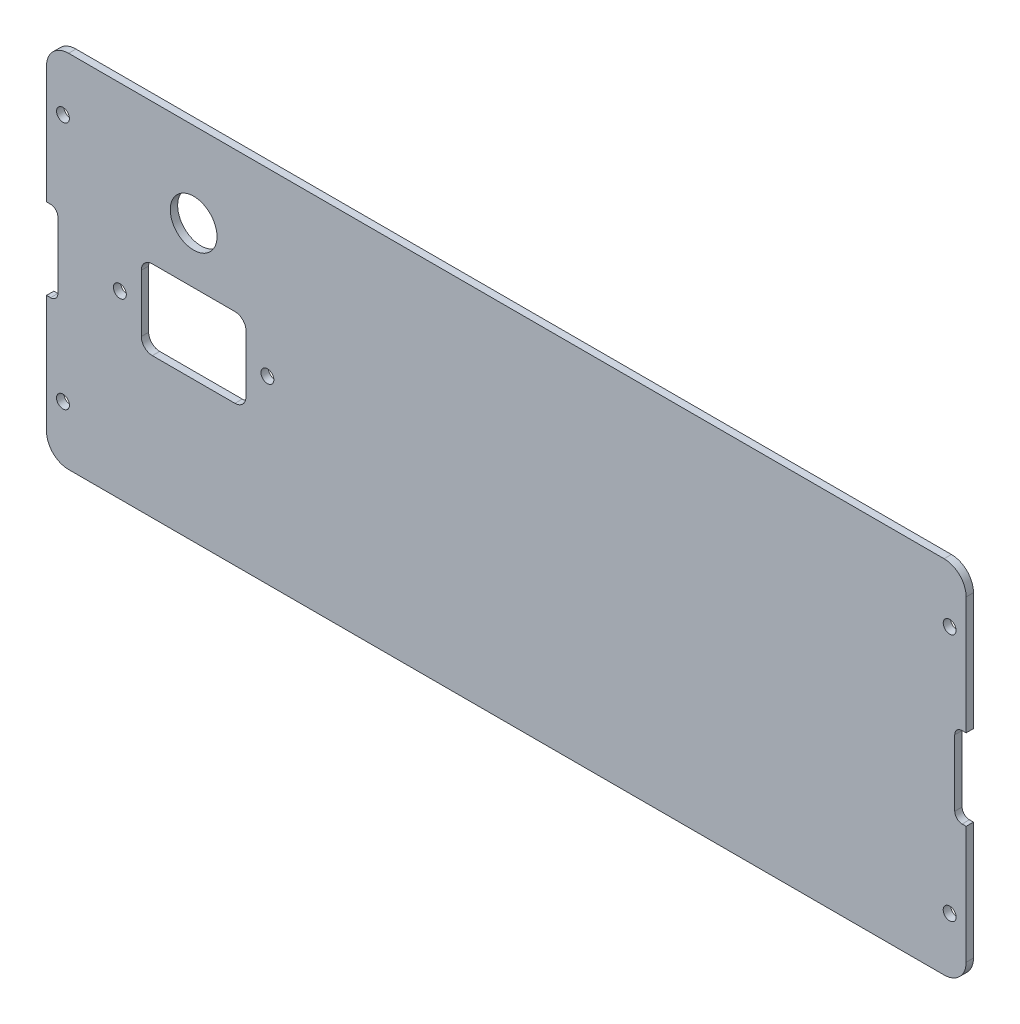
ISO-10303-21;
HEADER;
FILE_DESCRIPTION(('STEP AP214'),'2;1');
FILE_NAME('part.step','',(''),(''),'','','');
FILE_SCHEMA(('AUTOMOTIVE_DESIGN { 1 0 10303 214 1 1 1 1 }'));
ENDSEC;
DATA;
#1=APPLICATION_CONTEXT('core data for automotive mechanical design processes');
#2=APPLICATION_PROTOCOL_DEFINITION('international standard','automotive_design',2000,#1);
#3=PRODUCT_CONTEXT('',#1,'mechanical');
#4=PRODUCT('Part','Part','',(#3));
#5=PRODUCT_RELATED_PRODUCT_CATEGORY('part','',(#4));
#6=PRODUCT_DEFINITION_FORMATION('','',#4);
#7=PRODUCT_DEFINITION_CONTEXT('part definition',#1,'design');
#8=PRODUCT_DEFINITION('design','',#6,#7);
#9=PRODUCT_DEFINITION_SHAPE('','',#8);
#10=(LENGTH_UNIT() NAMED_UNIT(*) SI_UNIT(.MILLI.,.METRE.));
#11=(NAMED_UNIT(*) PLANE_ANGLE_UNIT() SI_UNIT($,.RADIAN.));
#12=(NAMED_UNIT(*) SI_UNIT($,.STERADIAN.) SOLID_ANGLE_UNIT());
#13=UNCERTAINTY_MEASURE_WITH_UNIT(LENGTH_MEASURE(1.E-05),#10,'distance_accuracy_value','');
#14=(GEOMETRIC_REPRESENTATION_CONTEXT(3) GLOBAL_UNCERTAINTY_ASSIGNED_CONTEXT((#13)) GLOBAL_UNIT_ASSIGNED_CONTEXT((#10,
#11,#12)) REPRESENTATION_CONTEXT('',''));
#15=CARTESIAN_POINT('',(0.,0.,0.));
#16=DIRECTION('',(0.,0.,1.));
#17=DIRECTION('',(1.,0.,0.));
#18=AXIS2_PLACEMENT_3D('',#15,#16,#17);
#19=CARTESIAN_POINT('',(0.,0.,2.));
#20=DIRECTION('',(0.,0.,-1.));
#21=DIRECTION('',(-1.,0.,0.));
#22=AXIS2_PLACEMENT_3D('',#19,#20,#21);
#23=PLANE('',#22);
#24=CARTESIAN_POINT('',(-85.,26.,2.));
#25=DIRECTION('',(0.,0.,1.));
#26=DIRECTION('',(1.,0.,0.));
#27=AXIS2_PLACEMENT_3D('',#24,#25,#26);
#28=CIRCLE('',#27,6.35);
#29=CARTESIAN_POINT('',(-78.65,26.,2.));
#30=VERTEX_POINT('',#29);
#31=EDGE_CURVE('E383',#30,#30,#28,.T.);
#32=ORIENTED_EDGE('',*,*,#31,.F.);
#33=EDGE_LOOP('',(#32));
#34=FACE_BOUND('',#33,.T.);
#35=CARTESIAN_POINT('',(-64.95,0.,2.));
#36=DIRECTION('',(0.,0.,1.));
#37=DIRECTION('',(1.,0.,0.));
#38=AXIS2_PLACEMENT_3D('',#35,#36,#37);
#39=CIRCLE('',#38,1.75);
#40=CARTESIAN_POINT('',(-63.2,0.,2.));
#41=VERTEX_POINT('',#40);
#42=EDGE_CURVE('E379',#41,#41,#39,.T.);
#43=ORIENTED_EDGE('',*,*,#42,.F.);
#44=EDGE_LOOP('',(#43));
#45=FACE_BOUND('',#44,.T.);
#46=CARTESIAN_POINT('',(-105.05,0.,2.));
#47=DIRECTION('',(0.,0.,1.));
#48=DIRECTION('',(1.,0.,0.));
#49=AXIS2_PLACEMENT_3D('',#46,#47,#48);
#50=CIRCLE('',#49,1.75);
#51=CARTESIAN_POINT('',(-103.3,0.,2.));
#52=VERTEX_POINT('',#51);
#53=EDGE_CURVE('E375',#52,#52,#50,.T.);
#54=ORIENTED_EDGE('',*,*,#53,.F.);
#55=EDGE_LOOP('',(#54));
#56=FACE_BOUND('',#55,.T.);
#57=DIRECTION('',(-1.,0.,0.));
#58=VECTOR('',#57,1.);
#59=CARTESIAN_POINT('',(-99.225,10.8,2.));
#60=LINE('',#59,#58);
#61=CARTESIAN_POINT('',(-73.775,10.8,2.));
#62=VERTEX_POINT('',#61);
#63=CARTESIAN_POINT('',(-96.225,10.8,2.));
#64=VERTEX_POINT('',#63);
#65=EDGE_CURVE('E523',#62,#64,#60,.T.);
#66=ORIENTED_EDGE('',*,*,#65,.F.);
#67=CARTESIAN_POINT('',(-73.775,7.8,2.));
#68=DIRECTION('',(0.,0.,-1.));
#69=DIRECTION('',(-1.,0.,0.));
#70=AXIS2_PLACEMENT_3D('',#67,#68,#69);
#71=CIRCLE('',#70,3.);
#72=CARTESIAN_POINT('',(-70.775,7.79999999999999,2.));
#73=VERTEX_POINT('',#72);
#74=EDGE_CURVE('E55',#62,#73,#71,.T.);
#75=ORIENTED_EDGE('',*,*,#74,.T.);
#76=DIRECTION('',(0.,1.,0.));
#77=VECTOR('',#76,1.);
#78=CARTESIAN_POINT('',(-70.775,-10.8,2.));
#79=LINE('',#78,#77);
#80=CARTESIAN_POINT('',(-70.775,-7.8,2.));
#81=VERTEX_POINT('',#80);
#82=EDGE_CURVE('E374',#81,#73,#79,.T.);
#83=ORIENTED_EDGE('',*,*,#82,.F.);
#84=CARTESIAN_POINT('',(-73.775,-7.8,2.));
#85=DIRECTION('',(0.,0.,-1.));
#86=DIRECTION('',(-1.,0.,0.));
#87=AXIS2_PLACEMENT_3D('',#84,#85,#86);
#88=CIRCLE('',#87,3.);
#89=CARTESIAN_POINT('',(-73.775,-10.8,2.));
#90=VERTEX_POINT('',#89);
#91=EDGE_CURVE('E406',#81,#90,#88,.T.);
#92=ORIENTED_EDGE('',*,*,#91,.T.);
#93=DIRECTION('',(1.,0.,0.));
#94=VECTOR('',#93,1.);
#95=CARTESIAN_POINT('',(-99.225,-10.8,2.));
#96=LINE('',#95,#94);
#97=CARTESIAN_POINT('',(-96.225,-10.8,2.));
#98=VERTEX_POINT('',#97);
#99=EDGE_CURVE('E517',#98,#90,#96,.T.);
#100=ORIENTED_EDGE('',*,*,#99,.F.);
#101=CARTESIAN_POINT('',(-96.225,-7.8,2.));
#102=DIRECTION('',(0.,0.,-1.));
#103=DIRECTION('',(-1.,0.,0.));
#104=AXIS2_PLACEMENT_3D('',#101,#102,#103);
#105=CIRCLE('',#104,3.);
#106=CARTESIAN_POINT('',(-99.225,-7.8,2.));
#107=VERTEX_POINT('',#106);
#108=EDGE_CURVE('E402',#98,#107,#105,.T.);
#109=ORIENTED_EDGE('',*,*,#108,.T.);
#110=DIRECTION('',(0.,-1.,0.));
#111=VECTOR('',#110,1.);
#112=CARTESIAN_POINT('',(-99.225,-10.8,2.));
#113=LINE('',#112,#111);
#114=CARTESIAN_POINT('',(-99.225,7.79999999999999,2.));
#115=VERTEX_POINT('',#114);
#116=EDGE_CURVE('E525',#115,#107,#113,.T.);
#117=ORIENTED_EDGE('',*,*,#116,.F.);
#118=CARTESIAN_POINT('',(-96.225,7.8,2.));
#119=DIRECTION('',(0.,0.,-1.));
#120=DIRECTION('',(-1.,0.,0.));
#121=AXIS2_PLACEMENT_3D('',#118,#119,#120);
#122=CIRCLE('',#121,3.);
#123=EDGE_CURVE('E41',#115,#64,#122,.T.);
#124=ORIENTED_EDGE('',*,*,#123,.T.);
#125=EDGE_LOOP('',(#66,#75,#83,#92,#100,#109,#117,#124));
#126=FACE_BOUND('',#125,.T.);
#127=CARTESIAN_POINT('',(-120.52,33.75,2.));
#128=DIRECTION('',(0.,0.,1.));
#129=DIRECTION('',(1.,0.,0.));
#130=AXIS2_PLACEMENT_3D('',#127,#128,#129);
#131=CIRCLE('',#130,1.74999999999999);
#132=CARTESIAN_POINT('',(-118.77,33.75,2.));
#133=VERTEX_POINT('',#132);
#134=EDGE_CURVE('E533',#133,#133,#131,.T.);
#135=ORIENTED_EDGE('',*,*,#134,.F.);
#136=EDGE_LOOP('',(#135));
#137=FACE_BOUND('',#136,.T.);
#138=CARTESIAN_POINT('',(-120.52,-33.75,2.));
#139=DIRECTION('',(0.,0.,1.));
#140=DIRECTION('',(1.,0.,0.));
#141=AXIS2_PLACEMENT_3D('',#138,#139,#140);
#142=CIRCLE('',#141,1.74999999999999);
#143=CARTESIAN_POINT('',(-118.77,-33.75,2.));
#144=VERTEX_POINT('',#143);
#145=EDGE_CURVE('E539',#144,#144,#142,.T.);
#146=ORIENTED_EDGE('',*,*,#145,.F.);
#147=EDGE_LOOP('',(#146));
#148=FACE_BOUND('',#147,.T.);
#149=CARTESIAN_POINT('',(120.52,33.75,2.));
#150=DIRECTION('',(0.,0.,1.));
#151=DIRECTION('',(1.,0.,0.));
#152=AXIS2_PLACEMENT_3D('',#149,#150,#151);
#153=CIRCLE('',#152,1.74999999999999);
#154=CARTESIAN_POINT('',(122.27,33.75,2.));
#155=VERTEX_POINT('',#154);
#156=EDGE_CURVE('E551',#155,#155,#153,.T.);
#157=ORIENTED_EDGE('',*,*,#156,.F.);
#158=EDGE_LOOP('',(#157));
#159=FACE_BOUND('',#158,.T.);
#160=DIRECTION('',(0.,1.,0.));
#161=VECTOR('',#160,1.);
#162=CARTESIAN_POINT('',(125.,-49.,2.));
#163=LINE('',#162,#161);
#164=CARTESIAN_POINT('',(125.,-43.,2.));
#165=VERTEX_POINT('',#164);
#166=CARTESIAN_POINT('',(125.,-11.,2.));
#167=VERTEX_POINT('',#166);
#168=EDGE_CURVE('E245',#165,#167,#163,.T.);
#169=ORIENTED_EDGE('',*,*,#168,.T.);
#170=DIRECTION('',(1.,0.,0.));
#171=VECTOR('',#170,1.);
#172=CARTESIAN_POINT('',(128.100000000001,-11.,2.));
#173=LINE('',#172,#171);
#174=CARTESIAN_POINT('',(123.900000000001,-11.,2.));
#175=VERTEX_POINT('',#174);
#176=EDGE_CURVE('E229',#175,#167,#173,.T.);
#177=ORIENTED_EDGE('',*,*,#176,.F.);
#178=CARTESIAN_POINT('',(123.900000000001,-8.99999999999997,2.));
#179=DIRECTION('',(0.,0.,-1.));
#180=DIRECTION('',(-1.,0.,0.));
#181=AXIS2_PLACEMENT_3D('',#178,#179,#180);
#182=CIRCLE('',#181,2.);
#183=CARTESIAN_POINT('',(121.900000000001,-8.99999999999997,2.));
#184=VERTEX_POINT('',#183);
#185=EDGE_CURVE('E343',#175,#184,#182,.T.);
#186=ORIENTED_EDGE('',*,*,#185,.T.);
#187=DIRECTION('',(0.,-1.,0.));
#188=VECTOR('',#187,1.);
#189=CARTESIAN_POINT('',(121.900000000001,-11.,2.));
#190=LINE('',#189,#188);
#191=CARTESIAN_POINT('',(121.900000000001,9.00000000000002,2.));
#192=VERTEX_POINT('',#191);
#193=EDGE_CURVE('E238',#192,#184,#190,.T.);
#194=ORIENTED_EDGE('',*,*,#193,.F.);
#195=CARTESIAN_POINT('',(123.900000000001,9.00000000000003,2.));
#196=DIRECTION('',(0.,0.,-1.));
#197=DIRECTION('',(-1.,0.,0.));
#198=AXIS2_PLACEMENT_3D('',#195,#196,#197);
#199=CIRCLE('',#198,2.);
#200=CARTESIAN_POINT('',(123.900000000001,11.,2.));
#201=VERTEX_POINT('',#200);
#202=EDGE_CURVE('E237',#192,#201,#199,.T.);
#203=ORIENTED_EDGE('',*,*,#202,.T.);
#204=DIRECTION('',(-1.,0.,0.));
#205=VECTOR('',#204,1.);
#206=CARTESIAN_POINT('',(128.100000000001,11.,2.));
#207=LINE('',#206,#205);
#208=CARTESIAN_POINT('',(125.,11.,2.));
#209=VERTEX_POINT('',#208);
#210=EDGE_CURVE('E221',#209,#201,#207,.T.);
#211=ORIENTED_EDGE('',*,*,#210,.F.);
#212=CARTESIAN_POINT('',(125.,43.,2.));
#213=VERTEX_POINT('',#212);
#214=EDGE_CURVE('E234',#209,#213,#163,.T.);
#215=ORIENTED_EDGE('',*,*,#214,.T.);
#216=CARTESIAN_POINT('',(119.,43.,2.));
#217=DIRECTION('',(0.,0.,-1.));
#218=DIRECTION('',(-1.,0.,0.));
#219=AXIS2_PLACEMENT_3D('',#216,#217,#218);
#220=CIRCLE('',#219,6.);
#221=CARTESIAN_POINT('',(119.,49.,2.));
#222=VERTEX_POINT('',#221);
#223=EDGE_CURVE('E293',#213,#222,#220,.F.);
#224=ORIENTED_EDGE('',*,*,#223,.T.);
#225=DIRECTION('',(1.,0.,0.));
#226=VECTOR('',#225,1.);
#227=CARTESIAN_POINT('',(-125.,49.,2.));
#228=LINE('',#227,#226);
#229=CARTESIAN_POINT('',(-119.,49.,2.));
#230=VERTEX_POINT('',#229);
#231=EDGE_CURVE('E246',#230,#222,#228,.T.);
#232=ORIENTED_EDGE('',*,*,#231,.F.);
#233=CARTESIAN_POINT('',(-119.,43.,2.));
#234=DIRECTION('',(0.,0.,-1.));
#235=DIRECTION('',(-1.,0.,0.));
#236=AXIS2_PLACEMENT_3D('',#233,#234,#235);
#237=CIRCLE('',#236,6.);
#238=CARTESIAN_POINT('',(-125.,43.,2.));
#239=VERTEX_POINT('',#238);
#240=EDGE_CURVE('E290',#230,#239,#237,.F.);
#241=ORIENTED_EDGE('',*,*,#240,.T.);
#242=DIRECTION('',(0.,1.,0.));
#243=VECTOR('',#242,1.);
#244=CARTESIAN_POINT('',(-125.,-49.,2.));
#245=LINE('',#244,#243);
#246=CARTESIAN_POINT('',(-125.,11.,2.));
#247=VERTEX_POINT('',#246);
#248=EDGE_CURVE('E271',#247,#239,#245,.T.);
#249=ORIENTED_EDGE('',*,*,#248,.F.);
#250=DIRECTION('',(-1.,0.,0.));
#251=VECTOR('',#250,1.);
#252=CARTESIAN_POINT('',(-128.100000000001,11.,2.));
#253=LINE('',#252,#251);
#254=CARTESIAN_POINT('',(-123.900000000001,11.,2.));
#255=VERTEX_POINT('',#254);
#256=EDGE_CURVE('E564',#255,#247,#253,.T.);
#257=ORIENTED_EDGE('',*,*,#256,.F.);
#258=CARTESIAN_POINT('',(-123.900000000001,9.,2.));
#259=DIRECTION('',(0.,0.,-1.));
#260=DIRECTION('',(-1.,0.,0.));
#261=AXIS2_PLACEMENT_3D('',#258,#259,#260);
#262=CIRCLE('',#261,2.);
#263=CARTESIAN_POINT('',(-121.900000000001,9.,2.));
#264=VERTEX_POINT('',#263);
#265=EDGE_CURVE('E354',#255,#264,#262,.T.);
#266=ORIENTED_EDGE('',*,*,#265,.T.);
#267=DIRECTION('',(0.,1.,0.));
#268=VECTOR('',#267,1.);
#269=CARTESIAN_POINT('',(-121.900000000001,-11.,2.));
#270=LINE('',#269,#268);
#271=CARTESIAN_POINT('',(-121.900000000001,-9.,2.));
#272=VERTEX_POINT('',#271);
#273=EDGE_CURVE('E561',#272,#264,#270,.T.);
#274=ORIENTED_EDGE('',*,*,#273,.F.);
#275=CARTESIAN_POINT('',(-123.900000000001,-9.,2.));
#276=DIRECTION('',(0.,0.,-1.));
#277=DIRECTION('',(-1.,0.,0.));
#278=AXIS2_PLACEMENT_3D('',#275,#276,#277);
#279=CIRCLE('',#278,2.);
#280=CARTESIAN_POINT('',(-123.900000000001,-11.,2.));
#281=VERTEX_POINT('',#280);
#282=EDGE_CURVE('E350',#272,#281,#279,.T.);
#283=ORIENTED_EDGE('',*,*,#282,.T.);
#284=DIRECTION('',(1.,0.,0.));
#285=VECTOR('',#284,1.);
#286=CARTESIAN_POINT('',(-128.100000000001,-11.,2.));
#287=LINE('',#286,#285);
#288=CARTESIAN_POINT('',(-125.,-11.,2.));
#289=VERTEX_POINT('',#288);
#290=EDGE_CURVE('E566',#289,#281,#287,.T.);
#291=ORIENTED_EDGE('',*,*,#290,.F.);
#292=CARTESIAN_POINT('',(-125.,-43.,2.));
#293=VERTEX_POINT('',#292);
#294=EDGE_CURVE('E250',#293,#289,#245,.T.);
#295=ORIENTED_EDGE('',*,*,#294,.F.);
#296=CARTESIAN_POINT('',(-119.,-43.,2.));
#297=DIRECTION('',(0.,0.,-1.));
#298=DIRECTION('',(-1.,0.,0.));
#299=AXIS2_PLACEMENT_3D('',#296,#297,#298);
#300=CIRCLE('',#299,6.);
#301=CARTESIAN_POINT('',(-119.,-49.,2.));
#302=VERTEX_POINT('',#301);
#303=EDGE_CURVE('E297',#293,#302,#300,.F.);
#304=ORIENTED_EDGE('',*,*,#303,.T.);
#305=DIRECTION('',(1.,0.,0.));
#306=VECTOR('',#305,1.);
#307=CARTESIAN_POINT('',(-125.,-49.,2.));
#308=LINE('',#307,#306);
#309=CARTESIAN_POINT('',(119.,-49.,2.));
#310=VERTEX_POINT('',#309);
#311=EDGE_CURVE('E248',#302,#310,#308,.T.);
#312=ORIENTED_EDGE('',*,*,#311,.T.);
#313=CARTESIAN_POINT('',(119.,-43.,2.));
#314=DIRECTION('',(0.,0.,-1.));
#315=DIRECTION('',(-1.,0.,0.));
#316=AXIS2_PLACEMENT_3D('',#313,#314,#315);
#317=CIRCLE('',#316,6.);
#318=EDGE_CURVE('E295',#310,#165,#317,.F.);
#319=ORIENTED_EDGE('',*,*,#318,.T.);
#320=EDGE_LOOP('',(#169,#177,#186,#194,#203,#211,#215,#224,#232,#241,#249,#257,#266,#274,#283,
#291,#295,#304,#312,#319));
#321=FACE_BOUND('',#320,.T.);
#322=CARTESIAN_POINT('',(120.52,-33.75,2.));
#323=DIRECTION('',(0.,0.,1.));
#324=DIRECTION('',(1.,0.,0.));
#325=AXIS2_PLACEMENT_3D('',#322,#323,#324);
#326=CIRCLE('',#325,1.74999999999999);
#327=CARTESIAN_POINT('',(122.27,-33.75,2.));
#328=VERTEX_POINT('',#327);
#329=EDGE_CURVE('E545',#328,#328,#326,.T.);
#330=ORIENTED_EDGE('',*,*,#329,.F.);
#331=EDGE_LOOP('',(#330));
#332=FACE_BOUND('',#331,.T.);
#333=ADVANCED_FACE('F33',(#34,#45,#56,#126,#137,#148,#159,#321,#332),#23,.F.);
#334=CARTESIAN_POINT('',(0.,0.,0.));
#335=DIRECTION('',(0.,0.,-1.));
#336=DIRECTION('',(-1.,0.,0.));
#337=AXIS2_PLACEMENT_3D('',#334,#335,#336);
#338=PLANE('',#337);
#339=CARTESIAN_POINT('',(-85.,26.,0.));
#340=DIRECTION('',(0.,0.,-1.));
#341=DIRECTION('',(-1.,0.,0.));
#342=AXIS2_PLACEMENT_3D('',#339,#340,#341);
#343=CIRCLE('',#342,6.35);
#344=CARTESIAN_POINT('',(-91.35,26.,0.));
#345=VERTEX_POINT('',#344);
#346=EDGE_CURVE('E380',#345,#345,#343,.T.);
#347=ORIENTED_EDGE('',*,*,#346,.F.);
#348=EDGE_LOOP('',(#347));
#349=FACE_BOUND('',#348,.T.);
#350=CARTESIAN_POINT('',(-64.95,0.,0.));
#351=DIRECTION('',(0.,0.,-1.));
#352=DIRECTION('',(-1.,0.,0.));
#353=AXIS2_PLACEMENT_3D('',#350,#351,#352);
#354=CIRCLE('',#353,1.75);
#355=CARTESIAN_POINT('',(-66.7,0.,0.));
#356=VERTEX_POINT('',#355);
#357=EDGE_CURVE('E376',#356,#356,#354,.T.);
#358=ORIENTED_EDGE('',*,*,#357,.F.);
#359=EDGE_LOOP('',(#358));
#360=FACE_BOUND('',#359,.T.);
#361=CARTESIAN_POINT('',(-105.05,0.,0.));
#362=DIRECTION('',(0.,0.,-1.));
#363=DIRECTION('',(-1.,0.,0.));
#364=AXIS2_PLACEMENT_3D('',#361,#362,#363);
#365=CIRCLE('',#364,1.75);
#366=CARTESIAN_POINT('',(-106.8,0.,0.));
#367=VERTEX_POINT('',#366);
#368=EDGE_CURVE('E371',#367,#367,#365,.T.);
#369=ORIENTED_EDGE('',*,*,#368,.F.);
#370=EDGE_LOOP('',(#369));
#371=FACE_BOUND('',#370,.T.);
#372=DIRECTION('',(0.,-1.,0.));
#373=VECTOR('',#372,1.);
#374=CARTESIAN_POINT('',(-70.775,0.,0.));
#375=LINE('',#374,#373);
#376=CARTESIAN_POINT('',(-70.775,7.8,0.));
#377=VERTEX_POINT('',#376);
#378=CARTESIAN_POINT('',(-70.775,-7.8,0.));
#379=VERTEX_POINT('',#378);
#380=EDGE_CURVE('E367',#377,#379,#375,.T.);
#381=ORIENTED_EDGE('',*,*,#380,.F.);
#382=CARTESIAN_POINT('',(-73.775,7.8,0.));
#383=DIRECTION('',(0.,0.,-1.));
#384=DIRECTION('',(-1.,0.,0.));
#385=AXIS2_PLACEMENT_3D('',#382,#383,#384);
#386=CIRCLE('',#385,3.);
#387=CARTESIAN_POINT('',(-73.775,10.8,0.));
#388=VERTEX_POINT('',#387);
#389=EDGE_CURVE('E411',#377,#388,#386,.F.);
#390=ORIENTED_EDGE('',*,*,#389,.T.);
#391=DIRECTION('',(1.,0.,0.));
#392=VECTOR('',#391,1.);
#393=CARTESIAN_POINT('',(0.,10.8,0.));
#394=LINE('',#393,#392);
#395=CARTESIAN_POINT('',(-96.225,10.8,0.));
#396=VERTEX_POINT('',#395);
#397=EDGE_CURVE('E358',#396,#388,#394,.T.);
#398=ORIENTED_EDGE('',*,*,#397,.F.);
#399=CARTESIAN_POINT('',(-96.225,7.8,0.));
#400=DIRECTION('',(0.,0.,-1.));
#401=DIRECTION('',(-1.,0.,0.));
#402=AXIS2_PLACEMENT_3D('',#399,#400,#401);
#403=CIRCLE('',#402,3.);
#404=CARTESIAN_POINT('',(-99.225,7.8,0.));
#405=VERTEX_POINT('',#404);
#406=EDGE_CURVE('E11',#396,#405,#403,.F.);
#407=ORIENTED_EDGE('',*,*,#406,.T.);
#408=DIRECTION('',(0.,1.,0.));
#409=VECTOR('',#408,1.);
#410=CARTESIAN_POINT('',(-99.225,0.,0.));
#411=LINE('',#410,#409);
#412=CARTESIAN_POINT('',(-99.225,-7.8,0.));
#413=VERTEX_POINT('',#412);
#414=EDGE_CURVE('E361',#413,#405,#411,.T.);
#415=ORIENTED_EDGE('',*,*,#414,.F.);
#416=CARTESIAN_POINT('',(-96.225,-7.8,0.));
#417=DIRECTION('',(0.,0.,-1.));
#418=DIRECTION('',(-1.,0.,0.));
#419=AXIS2_PLACEMENT_3D('',#416,#417,#418);
#420=CIRCLE('',#419,3.);
#421=CARTESIAN_POINT('',(-96.225,-10.8,0.));
#422=VERTEX_POINT('',#421);
#423=EDGE_CURVE('E404',#413,#422,#420,.F.);
#424=ORIENTED_EDGE('',*,*,#423,.T.);
#425=DIRECTION('',(-1.,0.,0.));
#426=VECTOR('',#425,1.);
#427=CARTESIAN_POINT('',(0.,-10.8,0.));
#428=LINE('',#427,#426);
#429=CARTESIAN_POINT('',(-73.775,-10.8,0.));
#430=VERTEX_POINT('',#429);
#431=EDGE_CURVE('E364',#430,#422,#428,.T.);
#432=ORIENTED_EDGE('',*,*,#431,.F.);
#433=CARTESIAN_POINT('',(-73.775,-7.8,0.));
#434=DIRECTION('',(0.,0.,-1.));
#435=DIRECTION('',(-1.,0.,0.));
#436=AXIS2_PLACEMENT_3D('',#433,#434,#435);
#437=CIRCLE('',#436,3.);
#438=EDGE_CURVE('E408',#430,#379,#437,.F.);
#439=ORIENTED_EDGE('',*,*,#438,.T.);
#440=EDGE_LOOP('',(#381,#390,#398,#407,#415,#424,#432,#439));
#441=FACE_BOUND('',#440,.T.);
#442=CARTESIAN_POINT('',(-120.52,33.75,0.));
#443=DIRECTION('',(0.,0.,1.));
#444=DIRECTION('',(1.,0.,0.));
#445=AXIS2_PLACEMENT_3D('',#442,#443,#444);
#446=CIRCLE('',#445,1.75);
#447=CARTESIAN_POINT('',(-118.77,33.75,0.));
#448=VERTEX_POINT('',#447);
#449=EDGE_CURVE('E536',#448,#448,#446,.T.);
#450=ORIENTED_EDGE('',*,*,#449,.T.);
#451=EDGE_LOOP('',(#450));
#452=FACE_BOUND('',#451,.T.);
#453=CARTESIAN_POINT('',(-120.52,-33.75,0.));
#454=DIRECTION('',(0.,0.,1.));
#455=DIRECTION('',(1.,0.,0.));
#456=AXIS2_PLACEMENT_3D('',#453,#454,#455);
#457=CIRCLE('',#456,1.75);
#458=CARTESIAN_POINT('',(-118.77,-33.75,0.));
#459=VERTEX_POINT('',#458);
#460=EDGE_CURVE('E542',#459,#459,#457,.T.);
#461=ORIENTED_EDGE('',*,*,#460,.T.);
#462=EDGE_LOOP('',(#461));
#463=FACE_BOUND('',#462,.T.);
#464=CARTESIAN_POINT('',(120.52,-33.75,0.));
#465=DIRECTION('',(0.,0.,1.));
#466=DIRECTION('',(1.,0.,0.));
#467=AXIS2_PLACEMENT_3D('',#464,#465,#466);
#468=CIRCLE('',#467,1.75);
#469=CARTESIAN_POINT('',(122.27,-33.75,0.));
#470=VERTEX_POINT('',#469);
#471=EDGE_CURVE('E548',#470,#470,#468,.T.);
#472=ORIENTED_EDGE('',*,*,#471,.T.);
#473=EDGE_LOOP('',(#472));
#474=FACE_BOUND('',#473,.T.);
#475=DIRECTION('',(-1.,0.,0.));
#476=VECTOR('',#475,1.);
#477=CARTESIAN_POINT('',(0.,-11.,0.));
#478=LINE('',#477,#476);
#479=CARTESIAN_POINT('',(125.,-11.,0.));
#480=VERTEX_POINT('',#479);
#481=CARTESIAN_POINT('',(123.900000000001,-11.,0.));
#482=VERTEX_POINT('',#481);
#483=EDGE_CURVE('E320',#480,#482,#478,.T.);
#484=ORIENTED_EDGE('',*,*,#483,.F.);
#485=DIRECTION('',(0.,1.,0.));
#486=VECTOR('',#485,1.);
#487=CARTESIAN_POINT('',(125.,-49.,0.));
#488=LINE('',#487,#486);
#489=CARTESIAN_POINT('',(125.,-43.,0.));
#490=VERTEX_POINT('',#489);
#491=EDGE_CURVE('E265',#490,#480,#488,.T.);
#492=ORIENTED_EDGE('',*,*,#491,.F.);
#493=CARTESIAN_POINT('',(119.,-43.,0.));
#494=DIRECTION('',(0.,0.,-1.));
#495=DIRECTION('',(-1.,0.,0.));
#496=AXIS2_PLACEMENT_3D('',#493,#494,#495);
#497=CIRCLE('',#496,6.);
#498=CARTESIAN_POINT('',(119.,-49.,0.));
#499=VERTEX_POINT('',#498);
#500=EDGE_CURVE('E281',#490,#499,#497,.T.);
#501=ORIENTED_EDGE('',*,*,#500,.T.);
#502=DIRECTION('',(1.,0.,0.));
#503=VECTOR('',#502,1.);
#504=CARTESIAN_POINT('',(-125.,-49.,0.));
#505=LINE('',#504,#503);
#506=CARTESIAN_POINT('',(-119.,-49.,0.));
#507=VERTEX_POINT('',#506);
#508=EDGE_CURVE('E268',#507,#499,#505,.T.);
#509=ORIENTED_EDGE('',*,*,#508,.F.);
#510=CARTESIAN_POINT('',(-119.,-43.,0.));
#511=DIRECTION('',(0.,0.,-1.));
#512=DIRECTION('',(-1.,0.,0.));
#513=AXIS2_PLACEMENT_3D('',#510,#511,#512);
#514=CIRCLE('',#513,6.);
#515=CARTESIAN_POINT('',(-125.,-43.,0.));
#516=VERTEX_POINT('',#515);
#517=EDGE_CURVE('E283',#507,#516,#514,.T.);
#518=ORIENTED_EDGE('',*,*,#517,.T.);
#519=DIRECTION('',(0.,1.,0.));
#520=VECTOR('',#519,1.);
#521=CARTESIAN_POINT('',(-125.,-49.,0.));
#522=LINE('',#521,#520);
#523=CARTESIAN_POINT('',(-125.,-11.,0.));
#524=VERTEX_POINT('',#523);
#525=EDGE_CURVE('E257',#516,#524,#522,.T.);
#526=ORIENTED_EDGE('',*,*,#525,.T.);
#527=DIRECTION('',(-1.,0.,0.));
#528=VECTOR('',#527,1.);
#529=CARTESIAN_POINT('',(0.,-11.,0.));
#530=LINE('',#529,#528);
#531=CARTESIAN_POINT('',(-123.900000000001,-11.,0.));
#532=VERTEX_POINT('',#531);
#533=EDGE_CURVE('E314',#532,#524,#530,.T.);
#534=ORIENTED_EDGE('',*,*,#533,.F.);
#535=CARTESIAN_POINT('',(-123.900000000001,-9.,0.));
#536=DIRECTION('',(0.,0.,-1.));
#537=DIRECTION('',(-1.,0.,0.));
#538=AXIS2_PLACEMENT_3D('',#535,#536,#537);
#539=CIRCLE('',#538,2.);
#540=CARTESIAN_POINT('',(-121.900000000001,-9.,0.));
#541=VERTEX_POINT('',#540);
#542=EDGE_CURVE('E352',#532,#541,#539,.F.);
#543=ORIENTED_EDGE('',*,*,#542,.T.);
#544=DIRECTION('',(0.,-1.,0.));
#545=VECTOR('',#544,1.);
#546=CARTESIAN_POINT('',(-121.900000000001,0.,0.));
#547=LINE('',#546,#545);
#548=CARTESIAN_POINT('',(-121.900000000001,9.,0.));
#549=VERTEX_POINT('',#548);
#550=EDGE_CURVE('E311',#549,#541,#547,.T.);
#551=ORIENTED_EDGE('',*,*,#550,.F.);
#552=CARTESIAN_POINT('',(-123.900000000001,9.,0.));
#553=DIRECTION('',(0.,0.,-1.));
#554=DIRECTION('',(-1.,0.,0.));
#555=AXIS2_PLACEMENT_3D('',#552,#553,#554);
#556=CIRCLE('',#555,2.);
#557=CARTESIAN_POINT('',(-123.900000000001,11.,0.));
#558=VERTEX_POINT('',#557);
#559=EDGE_CURVE('E356',#549,#558,#556,.F.);
#560=ORIENTED_EDGE('',*,*,#559,.T.);
#561=DIRECTION('',(1.,0.,0.));
#562=VECTOR('',#561,1.);
#563=CARTESIAN_POINT('',(0.,11.,0.));
#564=LINE('',#563,#562);
#565=CARTESIAN_POINT('',(-125.,11.,0.));
#566=VERTEX_POINT('',#565);
#567=EDGE_CURVE('E308',#566,#558,#564,.T.);
#568=ORIENTED_EDGE('',*,*,#567,.F.);
#569=CARTESIAN_POINT('',(-125.,43.,0.));
#570=VERTEX_POINT('',#569);
#571=EDGE_CURVE('E261',#566,#570,#522,.T.);
#572=ORIENTED_EDGE('',*,*,#571,.T.);
#573=CARTESIAN_POINT('',(-119.,43.,0.));
#574=DIRECTION('',(0.,0.,-1.));
#575=DIRECTION('',(-1.,0.,0.));
#576=AXIS2_PLACEMENT_3D('',#573,#574,#575);
#577=CIRCLE('',#576,6.);
#578=CARTESIAN_POINT('',(-119.,49.,0.));
#579=VERTEX_POINT('',#578);
#580=EDGE_CURVE('E276',#570,#579,#577,.T.);
#581=ORIENTED_EDGE('',*,*,#580,.T.);
#582=DIRECTION('',(1.,0.,0.));
#583=VECTOR('',#582,1.);
#584=CARTESIAN_POINT('',(-125.,49.,0.));
#585=LINE('',#584,#583);
#586=CARTESIAN_POINT('',(119.,49.,0.));
#587=VERTEX_POINT('',#586);
#588=EDGE_CURVE('E260',#579,#587,#585,.T.);
#589=ORIENTED_EDGE('',*,*,#588,.T.);
#590=CARTESIAN_POINT('',(119.,43.,0.));
#591=DIRECTION('',(0.,0.,-1.));
#592=DIRECTION('',(-1.,0.,0.));
#593=AXIS2_PLACEMENT_3D('',#590,#591,#592);
#594=CIRCLE('',#593,6.);
#595=CARTESIAN_POINT('',(125.,43.,0.));
#596=VERTEX_POINT('',#595);
#597=EDGE_CURVE('E278',#587,#596,#594,.T.);
#598=ORIENTED_EDGE('',*,*,#597,.T.);
#599=CARTESIAN_POINT('',(125.,11.,0.));
#600=VERTEX_POINT('',#599);
#601=EDGE_CURVE('E264',#600,#596,#488,.T.);
#602=ORIENTED_EDGE('',*,*,#601,.F.);
#603=DIRECTION('',(1.,0.,0.));
#604=VECTOR('',#603,1.);
#605=CARTESIAN_POINT('',(0.,11.,0.));
#606=LINE('',#605,#604);
#607=CARTESIAN_POINT('',(123.900000000001,11.,0.));
#608=VERTEX_POINT('',#607);
#609=EDGE_CURVE('E224',#608,#600,#606,.T.);
#610=ORIENTED_EDGE('',*,*,#609,.F.);
#611=CARTESIAN_POINT('',(123.900000000001,9.00000000000003,0.));
#612=DIRECTION('',(0.,0.,-1.));
#613=DIRECTION('',(-1.,0.,0.));
#614=AXIS2_PLACEMENT_3D('',#611,#612,#613);
#615=CIRCLE('',#614,2.);
#616=CARTESIAN_POINT('',(121.900000000001,9.00000000000002,0.));
#617=VERTEX_POINT('',#616);
#618=EDGE_CURVE('E348',#608,#617,#615,.F.);
#619=ORIENTED_EDGE('',*,*,#618,.T.);
#620=DIRECTION('',(0.,1.,0.));
#621=VECTOR('',#620,1.);
#622=CARTESIAN_POINT('',(121.900000000001,1.53791121252054E-13,0.));
#623=LINE('',#622,#621);
#624=CARTESIAN_POINT('',(121.900000000001,-8.99999999999997,0.));
#625=VERTEX_POINT('',#624);
#626=EDGE_CURVE('E317',#625,#617,#623,.T.);
#627=ORIENTED_EDGE('',*,*,#626,.F.);
#628=CARTESIAN_POINT('',(123.900000000001,-8.99999999999997,0.));
#629=DIRECTION('',(0.,0.,-1.));
#630=DIRECTION('',(-1.,0.,0.));
#631=AXIS2_PLACEMENT_3D('',#628,#629,#630);
#632=CIRCLE('',#631,2.);
#633=EDGE_CURVE('E345',#625,#482,#632,.F.);
#634=ORIENTED_EDGE('',*,*,#633,.T.);
#635=EDGE_LOOP('',(#484,#492,#501,#509,#518,#526,#534,#543,#551,#560,#568,#572,#581,#589,#598,
#602,#610,#619,#627,#634));
#636=FACE_BOUND('',#635,.T.);
#637=CARTESIAN_POINT('',(120.52,33.75,0.));
#638=DIRECTION('',(0.,0.,1.));
#639=DIRECTION('',(1.,0.,0.));
#640=AXIS2_PLACEMENT_3D('',#637,#638,#639);
#641=CIRCLE('',#640,1.75);
#642=CARTESIAN_POINT('',(122.27,33.75,0.));
#643=VERTEX_POINT('',#642);
#644=EDGE_CURVE('E239',#643,#643,#641,.T.);
#645=ORIENTED_EDGE('',*,*,#644,.T.);
#646=EDGE_LOOP('',(#645));
#647=FACE_BOUND('',#646,.T.);
#648=ADVANCED_FACE('F416',(#349,#360,#371,#441,#452,#463,#474,#636,#647),#338,.T.);
#649=CARTESIAN_POINT('',(125.,-49.,2.));
#650=DIRECTION('',(-1.,0.,0.));
#651=DIRECTION('',(0.,0.,1.));
#652=AXIS2_PLACEMENT_3D('',#649,#650,#651);
#653=PLANE('',#652);
#654=ORIENTED_EDGE('',*,*,#491,.T.);
#655=DIRECTION('',(0.,0.,1.));
#656=VECTOR('',#655,1.);
#657=CARTESIAN_POINT('',(125.,-11.,2.));
#658=LINE('',#657,#656);
#659=EDGE_CURVE('E228',#480,#167,#658,.T.);
#660=ORIENTED_EDGE('',*,*,#659,.T.);
#661=ORIENTED_EDGE('',*,*,#168,.F.);
#662=DIRECTION('',(0.,0.,-1.));
#663=VECTOR('',#662,1.);
#664=CARTESIAN_POINT('',(125.,-43.,2.));
#665=LINE('',#664,#663);
#666=EDGE_CURVE('E300',#165,#490,#665,.T.);
#667=ORIENTED_EDGE('',*,*,#666,.T.);
#668=EDGE_LOOP('',(#654,#660,#661,#667));
#669=FACE_BOUND('',#668,.T.);
#670=ADVANCED_FACE('F439',(#669),#653,.F.);
#671=CARTESIAN_POINT('',(-125.,-49.,2.));
#672=DIRECTION('',(-1.,0.,0.));
#673=DIRECTION('',(0.,0.,1.));
#674=AXIS2_PLACEMENT_3D('',#671,#672,#673);
#675=PLANE('',#674);
#676=DIRECTION('',(0.,0.,1.));
#677=VECTOR('',#676,1.);
#678=CARTESIAN_POINT('',(-125.,-11.,2.));
#679=LINE('',#678,#677);
#680=EDGE_CURVE('E571',#524,#289,#679,.T.);
#681=ORIENTED_EDGE('',*,*,#680,.F.);
#682=ORIENTED_EDGE('',*,*,#525,.F.);
#683=DIRECTION('',(0.,0.,-1.));
#684=VECTOR('',#683,1.);
#685=CARTESIAN_POINT('',(-125.,-43.,2.));
#686=LINE('',#685,#684);
#687=EDGE_CURVE('E288',#516,#293,#686,.F.);
#688=ORIENTED_EDGE('',*,*,#687,.T.);
#689=ORIENTED_EDGE('',*,*,#294,.T.);
#690=EDGE_LOOP('',(#681,#682,#688,#689));
#691=FACE_BOUND('',#690,.T.);
#692=ADVANCED_FACE('F462',(#691),#675,.T.);
#693=DIRECTION('',(0.,0.,-1.));
#694=VECTOR('',#693,1.);
#695=CARTESIAN_POINT('',(-125.,11.,2.));
#696=LINE('',#695,#694);
#697=EDGE_CURVE('E569',#247,#566,#696,.T.);
#698=ORIENTED_EDGE('',*,*,#697,.F.);
#699=ORIENTED_EDGE('',*,*,#248,.T.);
#700=DIRECTION('',(0.,0.,-1.));
#701=VECTOR('',#700,1.);
#702=CARTESIAN_POINT('',(-125.,43.,2.));
#703=LINE('',#702,#701);
#704=EDGE_CURVE('E285',#239,#570,#703,.T.);
#705=ORIENTED_EDGE('',*,*,#704,.T.);
#706=ORIENTED_EDGE('',*,*,#571,.F.);
#707=EDGE_LOOP('',(#698,#699,#705,#706));
#708=FACE_BOUND('',#707,.T.);
#709=ADVANCED_FACE('F451',(#708),#675,.T.);
#710=CARTESIAN_POINT('',(-125.,-49.,2.));
#711=DIRECTION('',(0.,1.,0.));
#712=DIRECTION('',(0.,0.,1.));
#713=AXIS2_PLACEMENT_3D('',#710,#711,#712);
#714=PLANE('',#713);
#715=ORIENTED_EDGE('',*,*,#311,.F.);
#716=DIRECTION('',(0.,0.,-1.));
#717=VECTOR('',#716,1.);
#718=CARTESIAN_POINT('',(-119.,-49.,0.));
#719=LINE('',#718,#717);
#720=EDGE_CURVE('E273',#302,#507,#719,.T.);
#721=ORIENTED_EDGE('',*,*,#720,.T.);
#722=ORIENTED_EDGE('',*,*,#508,.T.);
#723=DIRECTION('',(0.,0.,-1.));
#724=VECTOR('',#723,1.);
#725=CARTESIAN_POINT('',(119.,-49.,2.));
#726=LINE('',#725,#724);
#727=EDGE_CURVE('E256',#499,#310,#726,.F.);
#728=ORIENTED_EDGE('',*,*,#727,.T.);
#729=EDGE_LOOP('',(#715,#721,#722,#728));
#730=FACE_BOUND('',#729,.T.);
#731=ADVANCED_FACE('F448',(#730),#714,.F.);
#732=ORIENTED_EDGE('',*,*,#214,.F.);
#733=DIRECTION('',(0.,0.,-1.));
#734=VECTOR('',#733,1.);
#735=CARTESIAN_POINT('',(125.,11.,2.));
#736=LINE('',#735,#734);
#737=EDGE_CURVE('E218',#209,#600,#736,.T.);
#738=ORIENTED_EDGE('',*,*,#737,.T.);
#739=ORIENTED_EDGE('',*,*,#601,.T.);
#740=DIRECTION('',(0.,0.,-1.));
#741=VECTOR('',#740,1.);
#742=CARTESIAN_POINT('',(125.,43.,2.));
#743=LINE('',#742,#741);
#744=EDGE_CURVE('E243',#596,#213,#743,.F.);
#745=ORIENTED_EDGE('',*,*,#744,.T.);
#746=EDGE_LOOP('',(#732,#738,#739,#745));
#747=FACE_BOUND('',#746,.T.);
#748=ADVANCED_FACE('F241',(#747),#653,.F.);
#749=CARTESIAN_POINT('',(-125.,49.,2.));
#750=DIRECTION('',(0.,1.,0.));
#751=DIRECTION('',(0.,0.,1.));
#752=AXIS2_PLACEMENT_3D('',#749,#750,#751);
#753=PLANE('',#752);
#754=ORIENTED_EDGE('',*,*,#231,.T.);
#755=DIRECTION('',(0.,0.,-1.));
#756=VECTOR('',#755,1.);
#757=CARTESIAN_POINT('',(119.,49.,0.));
#758=LINE('',#757,#756);
#759=EDGE_CURVE('E305',#222,#587,#758,.T.);
#760=ORIENTED_EDGE('',*,*,#759,.T.);
#761=ORIENTED_EDGE('',*,*,#588,.F.);
#762=DIRECTION('',(0.,0.,-1.));
#763=VECTOR('',#762,1.);
#764=CARTESIAN_POINT('',(-119.,49.,2.));
#765=LINE('',#764,#763);
#766=EDGE_CURVE('E303',#579,#230,#765,.F.);
#767=ORIENTED_EDGE('',*,*,#766,.T.);
#768=EDGE_LOOP('',(#754,#760,#761,#767));
#769=FACE_BOUND('',#768,.T.);
#770=ADVANCED_FACE('F455',(#769),#753,.T.);
#771=CARTESIAN_POINT('',(-119.,-43.,2.));
#772=DIRECTION('',(0.,0.,1.));
#773=DIRECTION('',(1.,0.,0.));
#774=AXIS2_PLACEMENT_3D('',#771,#772,#773);
#775=CYLINDRICAL_SURFACE('',#774,6.);
#776=ORIENTED_EDGE('',*,*,#303,.F.);
#777=ORIENTED_EDGE('',*,*,#687,.F.);
#778=ORIENTED_EDGE('',*,*,#517,.F.);
#779=ORIENTED_EDGE('',*,*,#720,.F.);
#780=EDGE_LOOP('',(#776,#777,#778,#779));
#781=FACE_BOUND('',#780,.T.);
#782=ADVANCED_FACE('F458',(#781),#775,.T.);
#783=CARTESIAN_POINT('',(119.,-43.,2.));
#784=DIRECTION('',(0.,0.,-1.));
#785=DIRECTION('',(-1.,0.,0.));
#786=AXIS2_PLACEMENT_3D('',#783,#784,#785);
#787=CYLINDRICAL_SURFACE('',#786,6.);
#788=ORIENTED_EDGE('',*,*,#318,.F.);
#789=ORIENTED_EDGE('',*,*,#727,.F.);
#790=ORIENTED_EDGE('',*,*,#500,.F.);
#791=ORIENTED_EDGE('',*,*,#666,.F.);
#792=EDGE_LOOP('',(#788,#789,#790,#791));
#793=FACE_BOUND('',#792,.T.);
#794=ADVANCED_FACE('F466',(#793),#787,.T.);
#795=CARTESIAN_POINT('',(119.,43.,2.));
#796=DIRECTION('',(0.,0.,1.));
#797=DIRECTION('',(1.,0.,0.));
#798=AXIS2_PLACEMENT_3D('',#795,#796,#797);
#799=CYLINDRICAL_SURFACE('',#798,6.);
#800=ORIENTED_EDGE('',*,*,#223,.F.);
#801=ORIENTED_EDGE('',*,*,#744,.F.);
#802=ORIENTED_EDGE('',*,*,#597,.F.);
#803=ORIENTED_EDGE('',*,*,#759,.F.);
#804=EDGE_LOOP('',(#800,#801,#802,#803));
#805=FACE_BOUND('',#804,.T.);
#806=ADVANCED_FACE('F470',(#805),#799,.T.);
#807=CARTESIAN_POINT('',(-119.,43.,2.));
#808=DIRECTION('',(0.,0.,-1.));
#809=DIRECTION('',(-1.,0.,0.));
#810=AXIS2_PLACEMENT_3D('',#807,#808,#809);
#811=CYLINDRICAL_SURFACE('',#810,6.);
#812=ORIENTED_EDGE('',*,*,#240,.F.);
#813=ORIENTED_EDGE('',*,*,#766,.F.);
#814=ORIENTED_EDGE('',*,*,#580,.F.);
#815=ORIENTED_EDGE('',*,*,#704,.F.);
#816=EDGE_LOOP('',(#812,#813,#814,#815));
#817=FACE_BOUND('',#816,.T.);
#818=ADVANCED_FACE('F474',(#817),#811,.T.);
#819=CARTESIAN_POINT('',(-121.900000000001,-11.,-10.));
#820=DIRECTION('',(1.,0.,0.));
#821=DIRECTION('',(0.,0.,-1.));
#822=AXIS2_PLACEMENT_3D('',#819,#820,#821);
#823=PLANE('',#822);
#824=ORIENTED_EDGE('',*,*,#550,.T.);
#825=DIRECTION('',(0.,0.,1.));
#826=VECTOR('',#825,1.);
#827=CARTESIAN_POINT('',(-121.900000000001,-9.,2.));
#828=LINE('',#827,#826);
#829=EDGE_CURVE('E335',#541,#272,#828,.T.);
#830=ORIENTED_EDGE('',*,*,#829,.T.);
#831=ORIENTED_EDGE('',*,*,#273,.T.);
#832=DIRECTION('',(0.,0.,1.));
#833=VECTOR('',#832,1.);
#834=CARTESIAN_POINT('',(-121.900000000001,9.,0.));
#835=LINE('',#834,#833);
#836=EDGE_CURVE('E333',#264,#549,#835,.F.);
#837=ORIENTED_EDGE('',*,*,#836,.T.);
#838=EDGE_LOOP('',(#824,#830,#831,#837));
#839=FACE_BOUND('',#838,.T.);
#840=ADVANCED_FACE('F445',(#839),#823,.F.);
#841=CARTESIAN_POINT('',(-128.100000000001,-11.,-10.));
#842=DIRECTION('',(0.,-1.,0.));
#843=DIRECTION('',(0.,0.,-1.));
#844=AXIS2_PLACEMENT_3D('',#841,#842,#843);
#845=PLANE('',#844);
#846=ORIENTED_EDGE('',*,*,#290,.T.);
#847=DIRECTION('',(0.,0.,1.));
#848=VECTOR('',#847,1.);
#849=CARTESIAN_POINT('',(-123.900000000001,-11.,0.));
#850=LINE('',#849,#848);
#851=EDGE_CURVE('E338',#281,#532,#850,.F.);
#852=ORIENTED_EDGE('',*,*,#851,.T.);
#853=ORIENTED_EDGE('',*,*,#533,.T.);
#854=ORIENTED_EDGE('',*,*,#680,.T.);
#855=EDGE_LOOP('',(#846,#852,#853,#854));
#856=FACE_BOUND('',#855,.T.);
#857=ADVANCED_FACE('F616',(#856),#845,.F.);
#858=CARTESIAN_POINT('',(-128.100000000001,11.,-10.));
#859=DIRECTION('',(0.,1.,0.));
#860=DIRECTION('',(0.,0.,1.));
#861=AXIS2_PLACEMENT_3D('',#858,#859,#860);
#862=PLANE('',#861);
#863=ORIENTED_EDGE('',*,*,#567,.T.);
#864=DIRECTION('',(0.,0.,1.));
#865=VECTOR('',#864,1.);
#866=CARTESIAN_POINT('',(-123.900000000001,11.,2.));
#867=LINE('',#866,#865);
#868=EDGE_CURVE('E340',#558,#255,#867,.T.);
#869=ORIENTED_EDGE('',*,*,#868,.T.);
#870=ORIENTED_EDGE('',*,*,#256,.T.);
#871=ORIENTED_EDGE('',*,*,#697,.T.);
#872=EDGE_LOOP('',(#863,#869,#870,#871));
#873=FACE_BOUND('',#872,.T.);
#874=ADVANCED_FACE('F627',(#873),#862,.F.);
#875=CARTESIAN_POINT('',(128.100000000001,-11.,-10.));
#876=DIRECTION('',(0.,-1.,0.));
#877=DIRECTION('',(1.,0.,0.));
#878=AXIS2_PLACEMENT_3D('',#875,#876,#877);
#879=PLANE('',#878);
#880=ORIENTED_EDGE('',*,*,#483,.T.);
#881=DIRECTION('',(0.,0.,1.));
#882=VECTOR('',#881,1.);
#883=CARTESIAN_POINT('',(123.900000000001,-11.,2.));
#884=LINE('',#883,#882);
#885=EDGE_CURVE('E323',#482,#175,#884,.T.);
#886=ORIENTED_EDGE('',*,*,#885,.T.);
#887=ORIENTED_EDGE('',*,*,#176,.T.);
#888=ORIENTED_EDGE('',*,*,#659,.F.);
#889=EDGE_LOOP('',(#880,#886,#887,#888));
#890=FACE_BOUND('',#889,.T.);
#891=ADVANCED_FACE('F600',(#890),#879,.F.);
#892=CARTESIAN_POINT('',(128.100000000001,11.,-10.));
#893=DIRECTION('',(0.,1.,0.));
#894=DIRECTION('',(-1.,0.,0.));
#895=AXIS2_PLACEMENT_3D('',#892,#893,#894);
#896=PLANE('',#895);
#897=ORIENTED_EDGE('',*,*,#210,.T.);
#898=DIRECTION('',(0.,0.,1.));
#899=VECTOR('',#898,1.);
#900=CARTESIAN_POINT('',(123.900000000001,11.,0.));
#901=LINE('',#900,#899);
#902=EDGE_CURVE('E331',#201,#608,#901,.F.);
#903=ORIENTED_EDGE('',*,*,#902,.T.);
#904=ORIENTED_EDGE('',*,*,#609,.T.);
#905=ORIENTED_EDGE('',*,*,#737,.F.);
#906=EDGE_LOOP('',(#897,#903,#904,#905));
#907=FACE_BOUND('',#906,.T.);
#908=ADVANCED_FACE('F220',(#907),#896,.F.);
#909=CARTESIAN_POINT('',(121.900000000001,-11.,-10.));
#910=DIRECTION('',(-1.,0.,0.));
#911=DIRECTION('',(0.,-1.,0.));
#912=AXIS2_PLACEMENT_3D('',#909,#910,#911);
#913=PLANE('',#912);
#914=ORIENTED_EDGE('',*,*,#193,.T.);
#915=DIRECTION('',(0.,0.,1.));
#916=VECTOR('',#915,1.);
#917=CARTESIAN_POINT('',(121.900000000001,-8.99999999999997,0.));
#918=LINE('',#917,#916);
#919=EDGE_CURVE('E329',#184,#625,#918,.F.);
#920=ORIENTED_EDGE('',*,*,#919,.T.);
#921=ORIENTED_EDGE('',*,*,#626,.T.);
#922=DIRECTION('',(0.,0.,1.));
#923=VECTOR('',#922,1.);
#924=CARTESIAN_POINT('',(121.900000000001,9.00000000000002,2.));
#925=LINE('',#924,#923);
#926=EDGE_CURVE('E326',#617,#192,#925,.T.);
#927=ORIENTED_EDGE('',*,*,#926,.T.);
#928=EDGE_LOOP('',(#914,#920,#921,#927));
#929=FACE_BOUND('',#928,.T.);
#930=ADVANCED_FACE('F483',(#929),#913,.F.);
#931=CARTESIAN_POINT('',(123.900000000001,-8.99999999999997,-10.));
#932=DIRECTION('',(0.,0.,-1.));
#933=DIRECTION('',(-1.,0.,0.));
#934=AXIS2_PLACEMENT_3D('',#931,#932,#933);
#935=CYLINDRICAL_SURFACE('',#934,2.);
#936=ORIENTED_EDGE('',*,*,#633,.F.);
#937=ORIENTED_EDGE('',*,*,#919,.F.);
#938=ORIENTED_EDGE('',*,*,#185,.F.);
#939=ORIENTED_EDGE('',*,*,#885,.F.);
#940=EDGE_LOOP('',(#936,#937,#938,#939));
#941=FACE_BOUND('',#940,.T.);
#942=ADVANCED_FACE('F479',(#941),#935,.F.);
#943=CARTESIAN_POINT('',(123.900000000001,9.00000000000003,-10.));
#944=DIRECTION('',(0.,0.,-1.));
#945=DIRECTION('',(-1.,0.,0.));
#946=AXIS2_PLACEMENT_3D('',#943,#944,#945);
#947=CYLINDRICAL_SURFACE('',#946,2.);
#948=ORIENTED_EDGE('',*,*,#618,.F.);
#949=ORIENTED_EDGE('',*,*,#902,.F.);
#950=ORIENTED_EDGE('',*,*,#202,.F.);
#951=ORIENTED_EDGE('',*,*,#926,.F.);
#952=EDGE_LOOP('',(#948,#949,#950,#951));
#953=FACE_BOUND('',#952,.T.);
#954=ADVANCED_FACE('F482',(#953),#947,.F.);
#955=CARTESIAN_POINT('',(-123.900000000001,-9.,-10.));
#956=DIRECTION('',(0.,0.,-1.));
#957=DIRECTION('',(-1.,0.,0.));
#958=AXIS2_PLACEMENT_3D('',#955,#956,#957);
#959=CYLINDRICAL_SURFACE('',#958,2.);
#960=ORIENTED_EDGE('',*,*,#542,.F.);
#961=ORIENTED_EDGE('',*,*,#851,.F.);
#962=ORIENTED_EDGE('',*,*,#282,.F.);
#963=ORIENTED_EDGE('',*,*,#829,.F.);
#964=EDGE_LOOP('',(#960,#961,#962,#963));
#965=FACE_BOUND('',#964,.T.);
#966=ADVANCED_FACE('F487',(#965),#959,.F.);
#967=CARTESIAN_POINT('',(-123.900000000001,9.,-10.));
#968=DIRECTION('',(0.,0.,-1.));
#969=DIRECTION('',(-1.,0.,0.));
#970=AXIS2_PLACEMENT_3D('',#967,#968,#969);
#971=CYLINDRICAL_SURFACE('',#970,2.);
#972=ORIENTED_EDGE('',*,*,#559,.F.);
#973=ORIENTED_EDGE('',*,*,#836,.F.);
#974=ORIENTED_EDGE('',*,*,#265,.F.);
#975=ORIENTED_EDGE('',*,*,#868,.F.);
#976=EDGE_LOOP('',(#972,#973,#974,#975));
#977=FACE_BOUND('',#976,.T.);
#978=ADVANCED_FACE('F491',(#977),#971,.F.);
#979=CARTESIAN_POINT('',(120.52,33.75,2.));
#980=DIRECTION('',(0.,0.,1.));
#981=DIRECTION('',(1.,0.,0.));
#982=AXIS2_PLACEMENT_3D('',#979,#980,#981);
#983=CYLINDRICAL_SURFACE('',#982,1.74999999999999);
#984=ORIENTED_EDGE('',*,*,#644,.F.);
#985=EDGE_LOOP('',(#984));
#986=FACE_BOUND('',#985,.T.);
#987=ORIENTED_EDGE('',*,*,#156,.T.);
#988=EDGE_LOOP('',(#987));
#989=FACE_BOUND('',#988,.T.);
#990=ADVANCED_FACE('F495',(#986,#989),#983,.F.);
#991=CARTESIAN_POINT('',(120.52,-33.75,2.));
#992=DIRECTION('',(0.,0.,1.));
#993=DIRECTION('',(1.,0.,0.));
#994=AXIS2_PLACEMENT_3D('',#991,#992,#993);
#995=CYLINDRICAL_SURFACE('',#994,1.74999999999999);
#996=ORIENTED_EDGE('',*,*,#471,.F.);
#997=EDGE_LOOP('',(#996));
#998=FACE_BOUND('',#997,.T.);
#999=ORIENTED_EDGE('',*,*,#329,.T.);
#1000=EDGE_LOOP('',(#999));
#1001=FACE_BOUND('',#1000,.T.);
#1002=ADVANCED_FACE('F642',(#998,#1001),#995,.F.);
#1003=CARTESIAN_POINT('',(-120.52,-33.75,2.));
#1004=DIRECTION('',(0.,0.,1.));
#1005=DIRECTION('',(1.,0.,0.));
#1006=AXIS2_PLACEMENT_3D('',#1003,#1004,#1005);
#1007=CYLINDRICAL_SURFACE('',#1006,1.74999999999999);
#1008=ORIENTED_EDGE('',*,*,#460,.F.);
#1009=EDGE_LOOP('',(#1008));
#1010=FACE_BOUND('',#1009,.T.);
#1011=ORIENTED_EDGE('',*,*,#145,.T.);
#1012=EDGE_LOOP('',(#1011));
#1013=FACE_BOUND('',#1012,.T.);
#1014=ADVANCED_FACE('F646',(#1010,#1013),#1007,.F.);
#1015=CARTESIAN_POINT('',(-120.52,33.75,2.));
#1016=DIRECTION('',(0.,0.,1.));
#1017=DIRECTION('',(1.,0.,0.));
#1018=AXIS2_PLACEMENT_3D('',#1015,#1016,#1017);
#1019=CYLINDRICAL_SURFACE('',#1018,1.74999999999999);
#1020=ORIENTED_EDGE('',*,*,#449,.F.);
#1021=EDGE_LOOP('',(#1020));
#1022=FACE_BOUND('',#1021,.T.);
#1023=ORIENTED_EDGE('',*,*,#134,.T.);
#1024=EDGE_LOOP('',(#1023));
#1025=FACE_BOUND('',#1024,.T.);
#1026=ADVANCED_FACE('F650',(#1022,#1025),#1019,.F.);
#1027=CARTESIAN_POINT('',(-70.775,-10.8,-8.));
#1028=DIRECTION('',(1.,0.,0.));
#1029=DIRECTION('',(0.,0.,-1.));
#1030=AXIS2_PLACEMENT_3D('',#1027,#1028,#1029);
#1031=PLANE('',#1030);
#1032=ORIENTED_EDGE('',*,*,#380,.T.);
#1033=DIRECTION('',(0.,0.,1.));
#1034=VECTOR('',#1033,1.);
#1035=CARTESIAN_POINT('',(-70.775,-7.8,2.));
#1036=LINE('',#1035,#1034);
#1037=EDGE_CURVE('E395',#379,#81,#1036,.T.);
#1038=ORIENTED_EDGE('',*,*,#1037,.T.);
#1039=ORIENTED_EDGE('',*,*,#82,.T.);
#1040=DIRECTION('',(0.,0.,1.));
#1041=VECTOR('',#1040,1.);
#1042=CARTESIAN_POINT('',(-70.775,7.8,0.));
#1043=LINE('',#1042,#1041);
#1044=EDGE_CURVE('E393',#73,#377,#1043,.F.);
#1045=ORIENTED_EDGE('',*,*,#1044,.T.);
#1046=EDGE_LOOP('',(#1032,#1038,#1039,#1045));
#1047=FACE_BOUND('',#1046,.T.);
#1048=ADVANCED_FACE('F520',(#1047),#1031,.F.);
#1049=CARTESIAN_POINT('',(-99.225,-10.8,-8.));
#1050=DIRECTION('',(0.,-1.,0.));
#1051=DIRECTION('',(0.,0.,-1.));
#1052=AXIS2_PLACEMENT_3D('',#1049,#1050,#1051);
#1053=PLANE('',#1052);
#1054=ORIENTED_EDGE('',*,*,#431,.T.);
#1055=DIRECTION('',(0.,0.,1.));
#1056=VECTOR('',#1055,1.);
#1057=CARTESIAN_POINT('',(-96.225,-10.8,2.));
#1058=LINE('',#1057,#1056);
#1059=EDGE_CURVE('E385',#422,#98,#1058,.T.);
#1060=ORIENTED_EDGE('',*,*,#1059,.T.);
#1061=ORIENTED_EDGE('',*,*,#99,.T.);
#1062=DIRECTION('',(0.,0.,1.));
#1063=VECTOR('',#1062,1.);
#1064=CARTESIAN_POINT('',(-73.775,-10.8,0.));
#1065=LINE('',#1064,#1063);
#1066=EDGE_CURVE('E370',#90,#430,#1065,.F.);
#1067=ORIENTED_EDGE('',*,*,#1066,.T.);
#1068=EDGE_LOOP('',(#1054,#1060,#1061,#1067));
#1069=FACE_BOUND('',#1068,.T.);
#1070=ADVANCED_FACE('F513',(#1069),#1053,.F.);
#1071=CARTESIAN_POINT('',(-99.225,-10.8,-8.));
#1072=DIRECTION('',(-1.,0.,0.));
#1073=DIRECTION('',(0.,0.,1.));
#1074=AXIS2_PLACEMENT_3D('',#1071,#1072,#1073);
#1075=PLANE('',#1074);
#1076=ORIENTED_EDGE('',*,*,#116,.T.);
#1077=DIRECTION('',(0.,0.,1.));
#1078=VECTOR('',#1077,1.);
#1079=CARTESIAN_POINT('',(-99.225,-7.8,0.));
#1080=LINE('',#1079,#1078);
#1081=EDGE_CURVE('E391',#107,#413,#1080,.F.);
#1082=ORIENTED_EDGE('',*,*,#1081,.T.);
#1083=ORIENTED_EDGE('',*,*,#414,.T.);
#1084=DIRECTION('',(0.,0.,1.));
#1085=VECTOR('',#1084,1.);
#1086=CARTESIAN_POINT('',(-99.225,7.8,2.));
#1087=LINE('',#1086,#1085);
#1088=EDGE_CURVE('E388',#405,#115,#1087,.T.);
#1089=ORIENTED_EDGE('',*,*,#1088,.T.);
#1090=EDGE_LOOP('',(#1076,#1082,#1083,#1089));
#1091=FACE_BOUND('',#1090,.T.);
#1092=ADVANCED_FACE('F660',(#1091),#1075,.F.);
#1093=CARTESIAN_POINT('',(-99.225,10.8,-8.));
#1094=DIRECTION('',(0.,1.,0.));
#1095=DIRECTION('',(0.,0.,1.));
#1096=AXIS2_PLACEMENT_3D('',#1093,#1094,#1095);
#1097=PLANE('',#1096);
#1098=ORIENTED_EDGE('',*,*,#397,.T.);
#1099=DIRECTION('',(0.,0.,1.));
#1100=VECTOR('',#1099,1.);
#1101=CARTESIAN_POINT('',(-73.775,10.8,2.));
#1102=LINE('',#1101,#1100);
#1103=EDGE_CURVE('E400',#388,#62,#1102,.T.);
#1104=ORIENTED_EDGE('',*,*,#1103,.T.);
#1105=ORIENTED_EDGE('',*,*,#65,.T.);
#1106=DIRECTION('',(0.,0.,1.));
#1107=VECTOR('',#1106,1.);
#1108=CARTESIAN_POINT('',(-96.225,10.8,0.));
#1109=LINE('',#1108,#1107);
#1110=EDGE_CURVE('E398',#64,#396,#1109,.F.);
#1111=ORIENTED_EDGE('',*,*,#1110,.T.);
#1112=EDGE_LOOP('',(#1098,#1104,#1105,#1111));
#1113=FACE_BOUND('',#1112,.T.);
#1114=ADVANCED_FACE('F420',(#1113),#1097,.F.);
#1115=CARTESIAN_POINT('',(-105.05,0.,-8.));
#1116=DIRECTION('',(0.,0.,1.));
#1117=DIRECTION('',(1.,0.,0.));
#1118=AXIS2_PLACEMENT_3D('',#1115,#1116,#1117);
#1119=CYLINDRICAL_SURFACE('',#1118,1.75);
#1120=ORIENTED_EDGE('',*,*,#368,.T.);
#1121=EDGE_LOOP('',(#1120));
#1122=FACE_BOUND('',#1121,.T.);
#1123=ORIENTED_EDGE('',*,*,#53,.T.);
#1124=EDGE_LOOP('',(#1123));
#1125=FACE_BOUND('',#1124,.T.);
#1126=ADVANCED_FACE('F659',(#1122,#1125),#1119,.F.);
#1127=CARTESIAN_POINT('',(-64.95,0.,-8.));
#1128=DIRECTION('',(0.,0.,1.));
#1129=DIRECTION('',(1.,0.,0.));
#1130=AXIS2_PLACEMENT_3D('',#1127,#1128,#1129);
#1131=CYLINDRICAL_SURFACE('',#1130,1.75);
#1132=ORIENTED_EDGE('',*,*,#357,.T.);
#1133=EDGE_LOOP('',(#1132));
#1134=FACE_BOUND('',#1133,.T.);
#1135=ORIENTED_EDGE('',*,*,#42,.T.);
#1136=EDGE_LOOP('',(#1135));
#1137=FACE_BOUND('',#1136,.T.);
#1138=ADVANCED_FACE('F503',(#1134,#1137),#1131,.F.);
#1139=CARTESIAN_POINT('',(-85.,26.,-8.));
#1140=DIRECTION('',(0.,0.,1.));
#1141=DIRECTION('',(1.,0.,0.));
#1142=AXIS2_PLACEMENT_3D('',#1139,#1140,#1141);
#1143=CYLINDRICAL_SURFACE('',#1142,6.35);
#1144=ORIENTED_EDGE('',*,*,#346,.T.);
#1145=EDGE_LOOP('',(#1144));
#1146=FACE_BOUND('',#1145,.T.);
#1147=ORIENTED_EDGE('',*,*,#31,.T.);
#1148=EDGE_LOOP('',(#1147));
#1149=FACE_BOUND('',#1148,.T.);
#1150=ADVANCED_FACE('F498',(#1146,#1149),#1143,.F.);
#1151=CARTESIAN_POINT('',(-96.225,-7.8,-8.));
#1152=DIRECTION('',(0.,0.,-1.));
#1153=DIRECTION('',(-1.,0.,0.));
#1154=AXIS2_PLACEMENT_3D('',#1151,#1152,#1153);
#1155=CYLINDRICAL_SURFACE('',#1154,3.);
#1156=ORIENTED_EDGE('',*,*,#423,.F.);
#1157=ORIENTED_EDGE('',*,*,#1081,.F.);
#1158=ORIENTED_EDGE('',*,*,#108,.F.);
#1159=ORIENTED_EDGE('',*,*,#1059,.F.);
#1160=EDGE_LOOP('',(#1156,#1157,#1158,#1159));
#1161=FACE_BOUND('',#1160,.T.);
#1162=ADVANCED_FACE('F430',(#1161),#1155,.F.);
#1163=CARTESIAN_POINT('',(-73.775,-7.8,-8.));
#1164=DIRECTION('',(0.,0.,-1.));
#1165=DIRECTION('',(-1.,0.,0.));
#1166=AXIS2_PLACEMENT_3D('',#1163,#1164,#1165);
#1167=CYLINDRICAL_SURFACE('',#1166,3.);
#1168=ORIENTED_EDGE('',*,*,#438,.F.);
#1169=ORIENTED_EDGE('',*,*,#1066,.F.);
#1170=ORIENTED_EDGE('',*,*,#91,.F.);
#1171=ORIENTED_EDGE('',*,*,#1037,.F.);
#1172=EDGE_LOOP('',(#1168,#1169,#1170,#1171));
#1173=FACE_BOUND('',#1172,.T.);
#1174=ADVANCED_FACE('F424',(#1173),#1167,.F.);
#1175=CARTESIAN_POINT('',(-73.775,7.8,-8.));
#1176=DIRECTION('',(0.,0.,-1.));
#1177=DIRECTION('',(-1.,0.,0.));
#1178=AXIS2_PLACEMENT_3D('',#1175,#1176,#1177);
#1179=CYLINDRICAL_SURFACE('',#1178,3.);
#1180=ORIENTED_EDGE('',*,*,#389,.F.);
#1181=ORIENTED_EDGE('',*,*,#1044,.F.);
#1182=ORIENTED_EDGE('',*,*,#74,.F.);
#1183=ORIENTED_EDGE('',*,*,#1103,.F.);
#1184=EDGE_LOOP('',(#1180,#1181,#1182,#1183));
#1185=FACE_BOUND('',#1184,.T.);
#1186=ADVANCED_FACE('F422',(#1185),#1179,.F.);
#1187=CARTESIAN_POINT('',(-96.225,7.8,-8.));
#1188=DIRECTION('',(0.,0.,-1.));
#1189=DIRECTION('',(-1.,0.,0.));
#1190=AXIS2_PLACEMENT_3D('',#1187,#1188,#1189);
#1191=CYLINDRICAL_SURFACE('',#1190,3.);
#1192=ORIENTED_EDGE('',*,*,#406,.F.);
#1193=ORIENTED_EDGE('',*,*,#1110,.F.);
#1194=ORIENTED_EDGE('',*,*,#123,.F.);
#1195=ORIENTED_EDGE('',*,*,#1088,.F.);
#1196=EDGE_LOOP('',(#1192,#1193,#1194,#1195));
#1197=FACE_BOUND('',#1196,.T.);
#1198=ADVANCED_FACE('F35',(#1197),#1191,.F.);
#1199=CLOSED_SHELL('',(#333,#648,#670,#692,#709,#731,#748,#770,#782,#794,#806,#818,#840,#857,
#874,#891,#908,#930,#942,#954,#966,#978,#990,#1002,#1014,#1026,#1048,#1070,#1092,#1114,#1126,
#1138,#1150,#1162,#1174,#1186,#1198));
#1200=MANIFOLD_SOLID_BREP('B2',#1199);
#1201=ADVANCED_BREP_SHAPE_REPRESENTATION('',(#18,#1200),#14);
#1202=SHAPE_DEFINITION_REPRESENTATION(#9,#1201);
ENDSEC;
END-ISO-10303-21;
